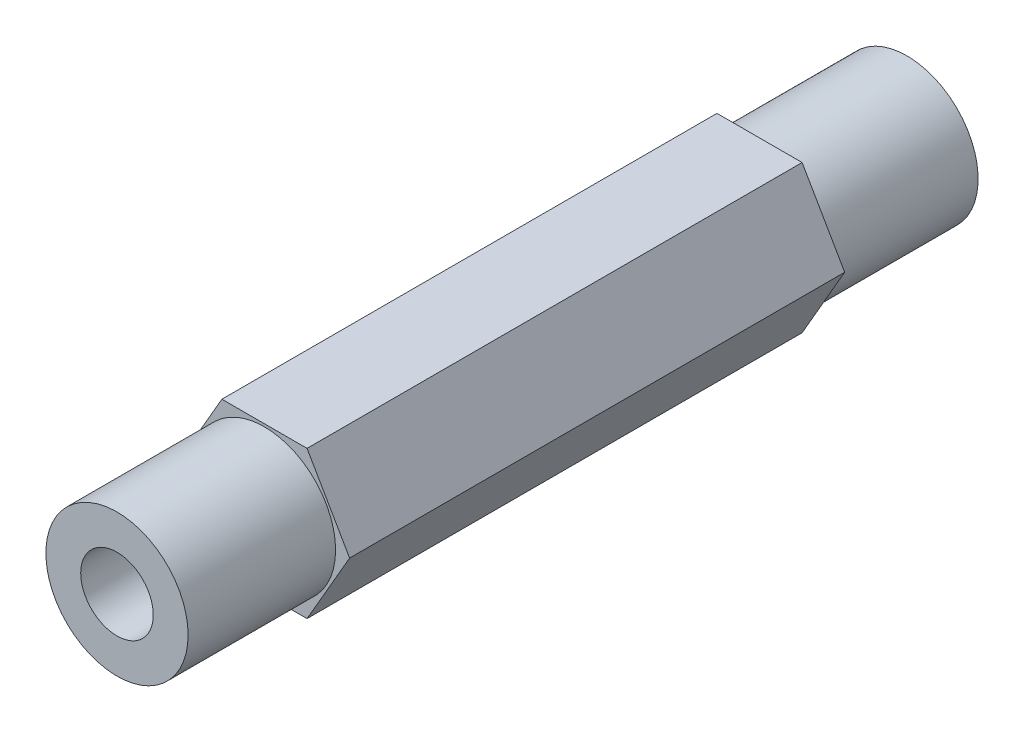
ISO-10303-21;
HEADER;
FILE_DESCRIPTION(('STEP AP214'),'2;1');
FILE_NAME('part.step','',(''),(''),'','','');
FILE_SCHEMA(('AUTOMOTIVE_DESIGN { 1 0 10303 214 1 1 1 1 }'));
ENDSEC;
DATA;
#1=APPLICATION_CONTEXT('core data for automotive mechanical design processes');
#2=APPLICATION_PROTOCOL_DEFINITION('international standard','automotive_design',2000,#1);
#3=PRODUCT_CONTEXT('',#1,'mechanical');
#4=PRODUCT('Part','Part','',(#3));
#5=PRODUCT_RELATED_PRODUCT_CATEGORY('part','',(#4));
#6=PRODUCT_DEFINITION_FORMATION('','',#4);
#7=PRODUCT_DEFINITION_CONTEXT('part definition',#1,'design');
#8=PRODUCT_DEFINITION('design','',#6,#7);
#9=PRODUCT_DEFINITION_SHAPE('','',#8);
#10=(LENGTH_UNIT() NAMED_UNIT(*) SI_UNIT(.MILLI.,.METRE.));
#11=(NAMED_UNIT(*) PLANE_ANGLE_UNIT() SI_UNIT($,.RADIAN.));
#12=(NAMED_UNIT(*) SI_UNIT($,.STERADIAN.) SOLID_ANGLE_UNIT());
#13=UNCERTAINTY_MEASURE_WITH_UNIT(LENGTH_MEASURE(1.E-05),#10,'distance_accuracy_value','');
#14=(GEOMETRIC_REPRESENTATION_CONTEXT(3) GLOBAL_UNCERTAINTY_ASSIGNED_CONTEXT((#13)) GLOBAL_UNIT_ASSIGNED_CONTEXT((#10,
#11,#12)) REPRESENTATION_CONTEXT('',''));
#15=CARTESIAN_POINT('',(0.,0.,0.));
#16=DIRECTION('',(0.,0.,1.));
#17=DIRECTION('',(1.,0.,0.));
#18=AXIS2_PLACEMENT_3D('',#15,#16,#17);
#19=CARTESIAN_POINT('',(8.21223022895324,0.,76.2));
#20=DIRECTION('',(-0.866025403784439,-0.5,0.));
#21=DIRECTION('',(0.5,-0.866025403784439,0.));
#22=AXIS2_PLACEMENT_3D('',#19,#20,#21);
#23=PLANE('',#22);
#24=DIRECTION('',(0.5,-0.866025403784439,0.));
#25=VECTOR('',#24,1.);
#26=CARTESIAN_POINT('',(4.10611511447662,7.112,14.224));
#27=LINE('',#26,#25);
#28=CARTESIAN_POINT('',(4.10611511447662,7.112,14.224));
#29=VERTEX_POINT('',#28);
#30=CARTESIAN_POINT('',(8.21223022895324,0.,14.224));
#31=VERTEX_POINT('',#30);
#32=EDGE_CURVE('E60',#29,#31,#27,.T.);
#33=ORIENTED_EDGE('',*,*,#32,.F.);
#34=DIRECTION('',(0.,0.,-1.));
#35=VECTOR('',#34,1.);
#36=CARTESIAN_POINT('',(4.10611511447662,7.112,76.2));
#37=LINE('',#36,#35);
#38=CARTESIAN_POINT('',(4.10611511447662,7.112,61.976));
#39=VERTEX_POINT('',#38);
#40=EDGE_CURVE('E11',#39,#29,#37,.T.);
#41=ORIENTED_EDGE('',*,*,#40,.F.);
#42=DIRECTION('',(-0.5,0.866025403784439,0.));
#43=VECTOR('',#42,1.);
#44=CARTESIAN_POINT('',(8.21223022895324,0.,61.976));
#45=LINE('',#44,#43);
#46=CARTESIAN_POINT('',(8.21223022895324,0.,61.976));
#47=VERTEX_POINT('',#46);
#48=EDGE_CURVE('E121',#47,#39,#45,.T.);
#49=ORIENTED_EDGE('',*,*,#48,.F.);
#50=DIRECTION('',(0.,0.,-1.));
#51=VECTOR('',#50,1.);
#52=CARTESIAN_POINT('',(8.21223022895324,0.,76.2));
#53=LINE('',#52,#51);
#54=EDGE_CURVE('E111',#47,#31,#53,.T.);
#55=ORIENTED_EDGE('',*,*,#54,.T.);
#56=EDGE_LOOP('',(#33,#41,#49,#55));
#57=FACE_BOUND('',#56,.T.);
#58=ADVANCED_FACE('F45',(#57),#23,.F.);
#59=CARTESIAN_POINT('',(4.10611511447662,7.112,76.2));
#60=DIRECTION('',(0.,-1.,0.));
#61=DIRECTION('',(1.,0.,0.));
#62=AXIS2_PLACEMENT_3D('',#59,#60,#61);
#63=PLANE('',#62);
#64=DIRECTION('',(1.,0.,0.));
#65=VECTOR('',#64,1.);
#66=CARTESIAN_POINT('',(-4.10611511447662,7.112,14.224));
#67=LINE('',#66,#65);
#68=CARTESIAN_POINT('',(-4.10611511447662,7.112,14.224));
#69=VERTEX_POINT('',#68);
#70=EDGE_CURVE('E96',#69,#29,#67,.T.);
#71=ORIENTED_EDGE('',*,*,#70,.F.);
#72=DIRECTION('',(0.,0.,-1.));
#73=VECTOR('',#72,1.);
#74=CARTESIAN_POINT('',(-4.10611511447662,7.112,76.2));
#75=LINE('',#74,#73);
#76=CARTESIAN_POINT('',(-4.10611511447662,7.112,61.976));
#77=VERTEX_POINT('',#76);
#78=EDGE_CURVE('E53',#77,#69,#75,.T.);
#79=ORIENTED_EDGE('',*,*,#78,.F.);
#80=DIRECTION('',(-1.,0.,0.));
#81=VECTOR('',#80,1.);
#82=CARTESIAN_POINT('',(4.10611511447662,7.112,61.976));
#83=LINE('',#82,#81);
#84=EDGE_CURVE('E117',#39,#77,#83,.T.);
#85=ORIENTED_EDGE('',*,*,#84,.F.);
#86=ORIENTED_EDGE('',*,*,#40,.T.);
#87=EDGE_LOOP('',(#71,#79,#85,#86));
#88=FACE_BOUND('',#87,.T.);
#89=ADVANCED_FACE('F116',(#88),#63,.F.);
#90=CARTESIAN_POINT('',(-4.10611511447662,7.112,76.2));
#91=DIRECTION('',(0.866025403784439,-0.5,0.));
#92=DIRECTION('',(0.5,0.866025403784439,0.));
#93=AXIS2_PLACEMENT_3D('',#90,#91,#92);
#94=PLANE('',#93);
#95=DIRECTION('',(0.5,0.866025403784439,0.));
#96=VECTOR('',#95,1.);
#97=CARTESIAN_POINT('',(-8.21223022895324,0.,14.224));
#98=LINE('',#97,#96);
#99=CARTESIAN_POINT('',(-8.21223022895324,0.,14.224));
#100=VERTEX_POINT('',#99);
#101=EDGE_CURVE('E99',#100,#69,#98,.T.);
#102=ORIENTED_EDGE('',*,*,#101,.F.);
#103=DIRECTION('',(0.,0.,-1.));
#104=VECTOR('',#103,1.);
#105=CARTESIAN_POINT('',(-8.21223022895324,0.,76.2));
#106=LINE('',#105,#104);
#107=CARTESIAN_POINT('',(-8.21223022895324,0.,61.976));
#108=VERTEX_POINT('',#107);
#109=EDGE_CURVE('E145',#108,#100,#106,.T.);
#110=ORIENTED_EDGE('',*,*,#109,.F.);
#111=DIRECTION('',(-0.5,-0.866025403784439,0.));
#112=VECTOR('',#111,1.);
#113=CARTESIAN_POINT('',(-4.10611511447662,7.112,61.976));
#114=LINE('',#113,#112);
#115=EDGE_CURVE('E120',#77,#108,#114,.T.);
#116=ORIENTED_EDGE('',*,*,#115,.F.);
#117=ORIENTED_EDGE('',*,*,#78,.T.);
#118=EDGE_LOOP('',(#102,#110,#116,#117));
#119=FACE_BOUND('',#118,.T.);
#120=ADVANCED_FACE('F150',(#119),#94,.F.);
#121=CARTESIAN_POINT('',(-8.21223022895324,0.,76.2));
#122=DIRECTION('',(0.866025403784439,0.5,0.));
#123=DIRECTION('',(-0.5,0.866025403784439,0.));
#124=AXIS2_PLACEMENT_3D('',#121,#122,#123);
#125=PLANE('',#124);
#126=DIRECTION('',(-0.5,0.866025403784439,0.));
#127=VECTOR('',#126,1.);
#128=CARTESIAN_POINT('',(-4.10611511447662,-7.112,14.224));
#129=LINE('',#128,#127);
#130=CARTESIAN_POINT('',(-4.10611511447662,-7.112,14.224));
#131=VERTEX_POINT('',#130);
#132=EDGE_CURVE('E158',#131,#100,#129,.T.);
#133=ORIENTED_EDGE('',*,*,#132,.F.);
#134=DIRECTION('',(0.,0.,-1.));
#135=VECTOR('',#134,1.);
#136=CARTESIAN_POINT('',(-4.10611511447662,-7.112,76.2));
#137=LINE('',#136,#135);
#138=CARTESIAN_POINT('',(-4.10611511447662,-7.112,61.976));
#139=VERTEX_POINT('',#138);
#140=EDGE_CURVE('E141',#139,#131,#137,.T.);
#141=ORIENTED_EDGE('',*,*,#140,.F.);
#142=DIRECTION('',(0.5,-0.866025403784439,0.));
#143=VECTOR('',#142,1.);
#144=CARTESIAN_POINT('',(-8.21223022895324,0.,61.976));
#145=LINE('',#144,#143);
#146=EDGE_CURVE('E125',#108,#139,#145,.T.);
#147=ORIENTED_EDGE('',*,*,#146,.F.);
#148=ORIENTED_EDGE('',*,*,#109,.T.);
#149=EDGE_LOOP('',(#133,#141,#147,#148));
#150=FACE_BOUND('',#149,.T.);
#151=ADVANCED_FACE('F157',(#150),#125,.F.);
#152=CARTESIAN_POINT('',(-4.10611511447662,-7.112,76.2));
#153=DIRECTION('',(0.,1.,0.));
#154=DIRECTION('',(-1.,0.,0.));
#155=AXIS2_PLACEMENT_3D('',#152,#153,#154);
#156=PLANE('',#155);
#157=DIRECTION('',(-1.,0.,0.));
#158=VECTOR('',#157,1.);
#159=CARTESIAN_POINT('',(4.10611511447662,-7.112,14.224));
#160=LINE('',#159,#158);
#161=CARTESIAN_POINT('',(4.10611511447662,-7.112,14.224));
#162=VERTEX_POINT('',#161);
#163=EDGE_CURVE('E163',#162,#131,#160,.T.);
#164=ORIENTED_EDGE('',*,*,#163,.F.);
#165=DIRECTION('',(0.,0.,-1.));
#166=VECTOR('',#165,1.);
#167=CARTESIAN_POINT('',(4.10611511447662,-7.112,76.2));
#168=LINE('',#167,#166);
#169=CARTESIAN_POINT('',(4.10611511447662,-7.112,61.976));
#170=VERTEX_POINT('',#169);
#171=EDGE_CURVE('E137',#170,#162,#168,.T.);
#172=ORIENTED_EDGE('',*,*,#171,.F.);
#173=DIRECTION('',(1.,0.,0.));
#174=VECTOR('',#173,1.);
#175=CARTESIAN_POINT('',(-4.10611511447662,-7.112,61.976));
#176=LINE('',#175,#174);
#177=EDGE_CURVE('E68',#139,#170,#176,.T.);
#178=ORIENTED_EDGE('',*,*,#177,.F.);
#179=ORIENTED_EDGE('',*,*,#140,.T.);
#180=EDGE_LOOP('',(#164,#172,#178,#179));
#181=FACE_BOUND('',#180,.T.);
#182=ADVANCED_FACE('F161',(#181),#156,.F.);
#183=CARTESIAN_POINT('',(4.10611511447662,-7.112,76.2));
#184=DIRECTION('',(-0.866025403784439,0.5,0.));
#185=DIRECTION('',(-0.5,-0.866025403784439,0.));
#186=AXIS2_PLACEMENT_3D('',#183,#184,#185);
#187=PLANE('',#186);
#188=DIRECTION('',(-0.5,-0.866025403784439,0.));
#189=VECTOR('',#188,1.);
#190=CARTESIAN_POINT('',(8.21223022895324,0.,14.224));
#191=LINE('',#190,#189);
#192=EDGE_CURVE('E113',#31,#162,#191,.T.);
#193=ORIENTED_EDGE('',*,*,#192,.F.);
#194=ORIENTED_EDGE('',*,*,#54,.F.);
#195=DIRECTION('',(0.5,0.866025403784439,0.));
#196=VECTOR('',#195,1.);
#197=CARTESIAN_POINT('',(4.10611511447662,-7.112,61.976));
#198=LINE('',#197,#196);
#199=EDGE_CURVE('E127',#170,#47,#198,.T.);
#200=ORIENTED_EDGE('',*,*,#199,.F.);
#201=ORIENTED_EDGE('',*,*,#171,.T.);
#202=EDGE_LOOP('',(#193,#194,#200,#201));
#203=FACE_BOUND('',#202,.T.);
#204=ADVANCED_FACE('F165',(#203),#187,.F.);
#205=CARTESIAN_POINT('',(0.,0.,61.976));
#206=DIRECTION('',(0.,0.,1.));
#207=DIRECTION('',(1.,0.,0.));
#208=AXIS2_PLACEMENT_3D('',#205,#206,#207);
#209=PLANE('',#208);
#210=CARTESIAN_POINT('',(0.,0.,61.976));
#211=DIRECTION('',(0.,0.,1.));
#212=DIRECTION('',(1.,0.,0.));
#213=AXIS2_PLACEMENT_3D('',#210,#211,#212);
#214=CIRCLE('',#213,6.86);
#215=CARTESIAN_POINT('',(6.86,0.,61.976));
#216=VERTEX_POINT('',#215);
#217=EDGE_CURVE('E167',#216,#216,#214,.T.);
#218=ORIENTED_EDGE('',*,*,#217,.F.);
#219=EDGE_LOOP('',(#218));
#220=FACE_BOUND('',#219,.T.);
#221=ORIENTED_EDGE('',*,*,#199,.T.);
#222=ORIENTED_EDGE('',*,*,#48,.T.);
#223=ORIENTED_EDGE('',*,*,#84,.T.);
#224=ORIENTED_EDGE('',*,*,#115,.T.);
#225=ORIENTED_EDGE('',*,*,#146,.T.);
#226=ORIENTED_EDGE('',*,*,#177,.T.);
#227=EDGE_LOOP('',(#221,#222,#223,#224,#225,#226));
#228=FACE_BOUND('',#227,.T.);
#229=ADVANCED_FACE('F153',(#220,#228),#209,.T.);
#230=CARTESIAN_POINT('',(0.,0.,61.976));
#231=DIRECTION('',(0.,0.,1.));
#232=DIRECTION('',(1.,0.,0.));
#233=AXIS2_PLACEMENT_3D('',#230,#231,#232);
#234=CYLINDRICAL_SURFACE('',#233,6.86);
#235=ORIENTED_EDGE('',*,*,#217,.T.);
#236=EDGE_LOOP('',(#235));
#237=FACE_BOUND('',#236,.T.);
#238=CARTESIAN_POINT('',(0.,0.,76.2));
#239=DIRECTION('',(0.,0.,1.));
#240=DIRECTION('',(1.,0.,0.));
#241=AXIS2_PLACEMENT_3D('',#238,#239,#240);
#242=CIRCLE('',#241,6.86);
#243=CARTESIAN_POINT('',(6.86,0.,76.2));
#244=VERTEX_POINT('',#243);
#245=EDGE_CURVE('E170',#244,#244,#242,.T.);
#246=ORIENTED_EDGE('',*,*,#245,.F.);
#247=EDGE_LOOP('',(#246));
#248=FACE_BOUND('',#247,.T.);
#249=ADVANCED_FACE('F242',(#237,#248),#234,.T.);
#250=CARTESIAN_POINT('',(0.,0.,76.2));
#251=DIRECTION('',(0.,0.,1.));
#252=DIRECTION('',(1.,0.,0.));
#253=AXIS2_PLACEMENT_3D('',#250,#251,#252);
#254=PLANE('',#253);
#255=CARTESIAN_POINT('',(0.,0.,76.2));
#256=DIRECTION('',(0.,0.,-1.));
#257=DIRECTION('',(-1.,0.,0.));
#258=AXIS2_PLACEMENT_3D('',#255,#256,#257);
#259=CIRCLE('',#258,3.5);
#260=CARTESIAN_POINT('',(-3.5,0.,76.2));
#261=VERTEX_POINT('',#260);
#262=EDGE_CURVE('E188',#261,#261,#259,.T.);
#263=ORIENTED_EDGE('',*,*,#262,.T.);
#264=EDGE_LOOP('',(#263));
#265=FACE_BOUND('',#264,.T.);
#266=ORIENTED_EDGE('',*,*,#245,.T.);
#267=EDGE_LOOP('',(#266));
#268=FACE_BOUND('',#267,.T.);
#269=ADVANCED_FACE('F200',(#265,#268),#254,.T.);
#270=CARTESIAN_POINT('',(0.,0.,14.224));
#271=DIRECTION('',(0.,0.,-1.));
#272=DIRECTION('',(-1.,0.,0.));
#273=AXIS2_PLACEMENT_3D('',#270,#271,#272);
#274=PLANE('',#273);
#275=CARTESIAN_POINT('',(0.,0.,14.224));
#276=DIRECTION('',(0.,0.,-1.));
#277=DIRECTION('',(-1.,0.,0.));
#278=AXIS2_PLACEMENT_3D('',#275,#276,#277);
#279=CIRCLE('',#278,6.86);
#280=CARTESIAN_POINT('',(-6.86,0.,14.224));
#281=VERTEX_POINT('',#280);
#282=EDGE_CURVE('E104',#281,#281,#279,.T.);
#283=ORIENTED_EDGE('',*,*,#282,.F.);
#284=EDGE_LOOP('',(#283));
#285=FACE_BOUND('',#284,.T.);
#286=ORIENTED_EDGE('',*,*,#70,.T.);
#287=ORIENTED_EDGE('',*,*,#32,.T.);
#288=ORIENTED_EDGE('',*,*,#192,.T.);
#289=ORIENTED_EDGE('',*,*,#163,.T.);
#290=ORIENTED_EDGE('',*,*,#132,.T.);
#291=ORIENTED_EDGE('',*,*,#101,.T.);
#292=EDGE_LOOP('',(#286,#287,#288,#289,#290,#291));
#293=FACE_BOUND('',#292,.T.);
#294=ADVANCED_FACE('F97',(#285,#293),#274,.T.);
#295=CARTESIAN_POINT('',(0.,0.,14.224));
#296=DIRECTION('',(0.,0.,-1.));
#297=DIRECTION('',(-1.,0.,0.));
#298=AXIS2_PLACEMENT_3D('',#295,#296,#297);
#299=CYLINDRICAL_SURFACE('',#298,6.86);
#300=ORIENTED_EDGE('',*,*,#282,.T.);
#301=EDGE_LOOP('',(#300));
#302=FACE_BOUND('',#301,.T.);
#303=CARTESIAN_POINT('',(0.,0.,0.));
#304=DIRECTION('',(0.,0.,-1.));
#305=DIRECTION('',(-1.,0.,0.));
#306=AXIS2_PLACEMENT_3D('',#303,#304,#305);
#307=CIRCLE('',#306,6.86);
#308=CARTESIAN_POINT('',(-6.86,0.,0.));
#309=VERTEX_POINT('',#308);
#310=EDGE_CURVE('E184',#309,#309,#307,.T.);
#311=ORIENTED_EDGE('',*,*,#310,.F.);
#312=EDGE_LOOP('',(#311));
#313=FACE_BOUND('',#312,.T.);
#314=ADVANCED_FACE('F212',(#302,#313),#299,.T.);
#315=CARTESIAN_POINT('',(0.,0.,0.));
#316=DIRECTION('',(0.,0.,1.));
#317=DIRECTION('',(1.,0.,0.));
#318=AXIS2_PLACEMENT_3D('',#315,#316,#317);
#319=PLANE('',#318);
#320=CARTESIAN_POINT('',(0.,0.,0.));
#321=DIRECTION('',(0.,0.,-1.));
#322=DIRECTION('',(-1.,0.,0.));
#323=AXIS2_PLACEMENT_3D('',#320,#321,#322);
#324=CIRCLE('',#323,3.5);
#325=CARTESIAN_POINT('',(-3.5,0.,0.));
#326=VERTEX_POINT('',#325);
#327=EDGE_CURVE('E192',#326,#326,#324,.T.);
#328=ORIENTED_EDGE('',*,*,#327,.F.);
#329=EDGE_LOOP('',(#328));
#330=FACE_BOUND('',#329,.T.);
#331=ORIENTED_EDGE('',*,*,#310,.T.);
#332=EDGE_LOOP('',(#331));
#333=FACE_BOUND('',#332,.T.);
#334=ADVANCED_FACE('F206',(#330,#333),#319,.F.);
#335=CARTESIAN_POINT('',(0.,0.,76.2));
#336=DIRECTION('',(0.,0.,-1.));
#337=DIRECTION('',(-1.,0.,0.));
#338=AXIS2_PLACEMENT_3D('',#335,#336,#337);
#339=CYLINDRICAL_SURFACE('',#338,3.5);
#340=ORIENTED_EDGE('',*,*,#262,.F.);
#341=EDGE_LOOP('',(#340));
#342=FACE_BOUND('',#341,.T.);
#343=ORIENTED_EDGE('',*,*,#327,.T.);
#344=EDGE_LOOP('',(#343));
#345=FACE_BOUND('',#344,.T.);
#346=ADVANCED_FACE('F203',(#342,#345),#339,.F.);
#347=CLOSED_SHELL('',(#58,#89,#120,#151,#182,#204,#229,#249,#269,#294,#314,#334,#346));
#348=MANIFOLD_SOLID_BREP('B2',#347);
#349=ADVANCED_BREP_SHAPE_REPRESENTATION('',(#18,#348),#14);
#350=SHAPE_DEFINITION_REPRESENTATION(#9,#349);
ENDSEC;
END-ISO-10303-21;
